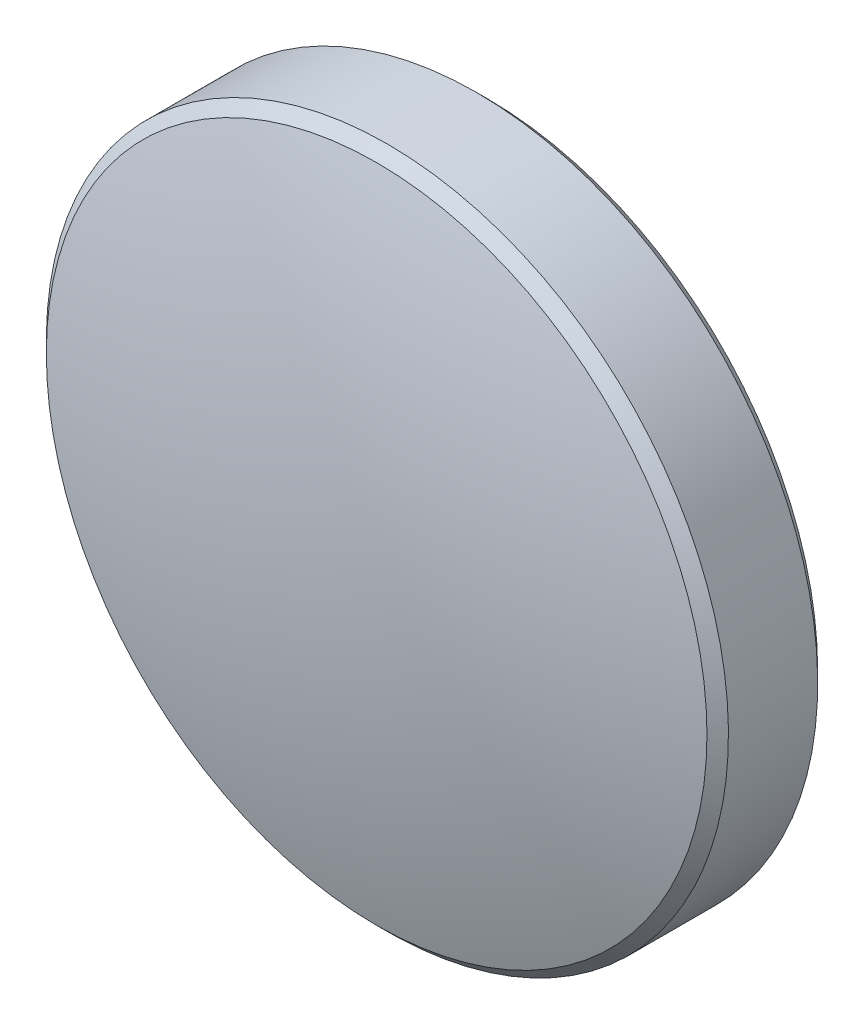
ISO-10303-21;
HEADER;
FILE_DESCRIPTION(('STEP AP214'),'2;1');
FILE_NAME('part.step','',(''),(''),'','','');
FILE_SCHEMA(('AUTOMOTIVE_DESIGN { 1 0 10303 214 1 1 1 1 }'));
ENDSEC;
DATA;
#1=APPLICATION_CONTEXT('core data for automotive mechanical design processes');
#2=APPLICATION_PROTOCOL_DEFINITION('international standard','automotive_design',2000,#1);
#3=PRODUCT_CONTEXT('',#1,'mechanical');
#4=PRODUCT('Part','Part','',(#3));
#5=PRODUCT_RELATED_PRODUCT_CATEGORY('part','',(#4));
#6=PRODUCT_DEFINITION_FORMATION('','',#4);
#7=PRODUCT_DEFINITION_CONTEXT('part definition',#1,'design');
#8=PRODUCT_DEFINITION('design','',#6,#7);
#9=PRODUCT_DEFINITION_SHAPE('','',#8);
#10=(LENGTH_UNIT() NAMED_UNIT(*) SI_UNIT(.MILLI.,.METRE.));
#11=(NAMED_UNIT(*) PLANE_ANGLE_UNIT() SI_UNIT($,.RADIAN.));
#12=(NAMED_UNIT(*) SI_UNIT($,.STERADIAN.) SOLID_ANGLE_UNIT());
#13=UNCERTAINTY_MEASURE_WITH_UNIT(LENGTH_MEASURE(1.E-05),#10,'distance_accuracy_value','');
#14=(GEOMETRIC_REPRESENTATION_CONTEXT(3) GLOBAL_UNCERTAINTY_ASSIGNED_CONTEXT((#13)) GLOBAL_UNIT_ASSIGNED_CONTEXT((#10,
#11,#12)) REPRESENTATION_CONTEXT('',''));
#15=CARTESIAN_POINT('',(0.,0.,0.));
#16=DIRECTION('',(0.,0.,1.));
#17=DIRECTION('',(1.,0.,0.));
#18=AXIS2_PLACEMENT_3D('',#15,#16,#17);
#19=CARTESIAN_POINT('',(0.,0.,-1.49));
#20=DIRECTION('',(0.,0.,-1.));
#21=DIRECTION('',(0.,1.,0.));
#22=AXIS2_PLACEMENT_3D('',#19,#20,#21);
#23=CYLINDRICAL_SURFACE('',#22,6.35);
#24=CARTESIAN_POINT('',(0.,0.,0.371110804326906));
#25=DIRECTION('',(0.,0.,-1.));
#26=DIRECTION('',(0.,1.,0.));
#27=AXIS2_PLACEMENT_3D('',#24,#25,#26);
#28=CIRCLE('',#27,6.34999999999999);
#29=CARTESIAN_POINT('',(0.,6.35,0.371110804326897));
#30=VERTEX_POINT('',#29);
#31=EDGE_CURVE('E23',#30,#30,#28,.T.);
#32=ORIENTED_EDGE('',*,*,#31,.T.);
#33=EDGE_LOOP('',(#32));
#34=FACE_BOUND('',#33,.T.);
#35=CARTESIAN_POINT('',(0.,0.,-1.28999999999999));
#36=DIRECTION('',(0.,0.,-1.));
#37=DIRECTION('',(0.,1.,0.));
#38=AXIS2_PLACEMENT_3D('',#35,#36,#37);
#39=CIRCLE('',#38,6.35);
#40=CARTESIAN_POINT('',(0.,6.35,-1.29));
#41=VERTEX_POINT('',#40);
#42=EDGE_CURVE('E19',#41,#41,#39,.T.);
#43=ORIENTED_EDGE('',*,*,#42,.F.);
#44=EDGE_LOOP('',(#43));
#45=FACE_BOUND('',#44,.T.);
#46=ADVANCED_FACE('F12',(#34,#45),#23,.T.);
#47=CARTESIAN_POINT('',(0.,0.,-1.28999999999999));
#48=DIRECTION('',(0.,0.,1.));
#49=DIRECTION('',(0.,-1.,0.));
#50=AXIS2_PLACEMENT_3D('',#47,#48,#49);
#51=CONICAL_SURFACE('',#50,6.35,0.785398163397447);
#52=CARTESIAN_POINT('',(0.,0.,-1.48999999999999));
#53=DIRECTION('',(0.,0.,-1.));
#54=DIRECTION('',(0.,1.,0.));
#55=AXIS2_PLACEMENT_3D('',#52,#53,#54);
#56=CIRCLE('',#55,6.15);
#57=CARTESIAN_POINT('',(0.,6.15,-1.49));
#58=VERTEX_POINT('',#57);
#59=EDGE_CURVE('E8',#58,#58,#56,.T.);
#60=ORIENTED_EDGE('',*,*,#59,.F.);
#61=EDGE_LOOP('',(#60));
#62=FACE_BOUND('',#61,.T.);
#63=ORIENTED_EDGE('',*,*,#42,.T.);
#64=EDGE_LOOP('',(#63));
#65=FACE_BOUND('',#64,.T.);
#66=ADVANCED_FACE('F46',(#62,#65),#51,.T.);
#67=CARTESIAN_POINT('',(0.,0.,-1.49));
#68=DIRECTION('',(0.,0.,-1.));
#69=DIRECTION('',(0.,1.,0.));
#70=AXIS2_PLACEMENT_3D('',#67,#68,#69);
#71=PLANE('',#70);
#72=ORIENTED_EDGE('',*,*,#59,.T.);
#73=EDGE_LOOP('',(#72));
#74=FACE_BOUND('',#73,.T.);
#75=ADVANCED_FACE('F14',(#74),#71,.T.);
#76=CARTESIAN_POINT('',(0.,0.,0.571110804326905));
#77=DIRECTION('',(0.,0.,-1.));
#78=DIRECTION('',(0.,1.,0.));
#79=AXIS2_PLACEMENT_3D('',#76,#77,#78);
#80=CONICAL_SURFACE('',#79,6.15,0.785398163397446);
#81=ORIENTED_EDGE('',*,*,#31,.F.);
#82=EDGE_LOOP('',(#81));
#83=FACE_BOUND('',#82,.T.);
#84=CARTESIAN_POINT('',(0.,0.,0.571110804326905));
#85=DIRECTION('',(0.,0.,-1.));
#86=DIRECTION('',(0.,1.,0.));
#87=AXIS2_PLACEMENT_3D('',#84,#85,#86);
#88=CIRCLE('',#87,6.15);
#89=CARTESIAN_POINT('',(0.,6.15,0.571110804326897));
#90=VERTEX_POINT('',#89);
#91=EDGE_CURVE('E27',#90,#90,#88,.T.);
#92=ORIENTED_EDGE('',*,*,#91,.T.);
#93=EDGE_LOOP('',(#92));
#94=FACE_BOUND('',#93,.T.);
#95=ADVANCED_FACE('F33',(#83,#94),#80,.T.);
#96=CARTESIAN_POINT('',(0.,0.,-19.5500000000002));
#97=DIRECTION('',(0.,0.,-1.));
#98=DIRECTION('',(0.,1.,0.));
#99=AXIS2_PLACEMENT_3D('',#96,#97,#98);
#100=SPHERICAL_SURFACE('',#99,21.0400000000002);
#101=ORIENTED_EDGE('',*,*,#91,.F.);
#102=EDGE_LOOP('',(#101));
#103=FACE_BOUND('',#102,.T.);
#104=ADVANCED_FACE('F35',(#103),#100,.T.);
#105=CLOSED_SHELL('',(#46,#66,#75,#95,#104));
#106=MANIFOLD_SOLID_BREP('B1',#105);
#107=ADVANCED_BREP_SHAPE_REPRESENTATION('',(#18,#106),#14);
#108=SHAPE_DEFINITION_REPRESENTATION(#9,#107);
ENDSEC;
END-ISO-10303-21;
